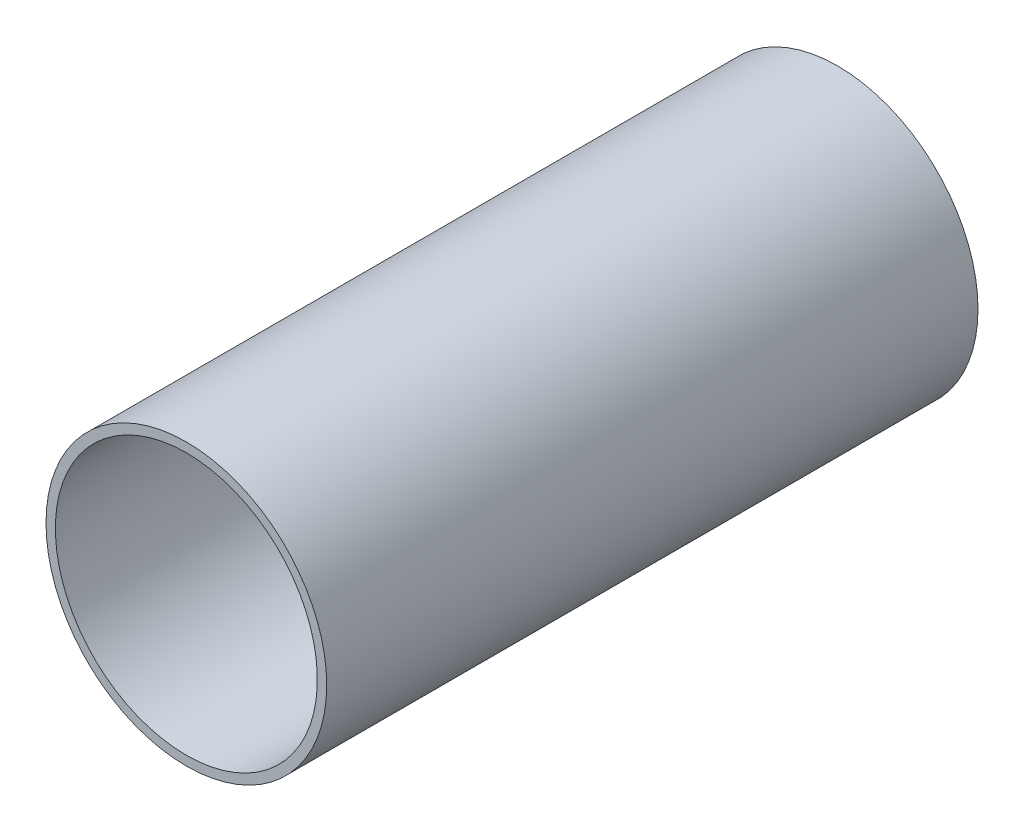
ISO-10303-21;
HEADER;
FILE_DESCRIPTION(('STEP AP214'),'2;1');
FILE_NAME('part.step','',(''),(''),'','','');
FILE_SCHEMA(('AUTOMOTIVE_DESIGN { 1 0 10303 214 1 1 1 1 }'));
ENDSEC;
DATA;
#1=APPLICATION_CONTEXT('core data for automotive mechanical design processes');
#2=APPLICATION_PROTOCOL_DEFINITION('international standard','automotive_design',2000,#1);
#3=PRODUCT_CONTEXT('',#1,'mechanical');
#4=PRODUCT('Part','Part','',(#3));
#5=PRODUCT_RELATED_PRODUCT_CATEGORY('part','',(#4));
#6=PRODUCT_DEFINITION_FORMATION('','',#4);
#7=PRODUCT_DEFINITION_CONTEXT('part definition',#1,'design');
#8=PRODUCT_DEFINITION('design','',#6,#7);
#9=PRODUCT_DEFINITION_SHAPE('','',#8);
#10=(LENGTH_UNIT() NAMED_UNIT(*) SI_UNIT(.MILLI.,.METRE.));
#11=(NAMED_UNIT(*) PLANE_ANGLE_UNIT() SI_UNIT($,.RADIAN.));
#12=(NAMED_UNIT(*) SI_UNIT($,.STERADIAN.) SOLID_ANGLE_UNIT());
#13=UNCERTAINTY_MEASURE_WITH_UNIT(LENGTH_MEASURE(1.E-05),#10,'distance_accuracy_value','');
#14=(GEOMETRIC_REPRESENTATION_CONTEXT(3) GLOBAL_UNCERTAINTY_ASSIGNED_CONTEXT((#13)) GLOBAL_UNIT_ASSIGNED_CONTEXT((#10,
#11,#12)) REPRESENTATION_CONTEXT('',''));
#15=CARTESIAN_POINT('',(0.,0.,0.));
#16=DIRECTION('',(0.,0.,1.));
#17=DIRECTION('',(1.,0.,0.));
#18=AXIS2_PLACEMENT_3D('',#15,#16,#17);
#19=CARTESIAN_POINT('',(115.401,-113.808,-0.045));
#20=DIRECTION('',(0.,0.,-1.));
#21=DIRECTION('',(0.,-1.,0.));
#22=AXIS2_PLACEMENT_3D('',#19,#20,#21);
#23=CYLINDRICAL_SURFACE('',#22,0.35);
#24=CARTESIAN_POINT('',(115.401,-113.808,-0.035));
#25=DIRECTION('',(0.,0.,-1.));
#26=DIRECTION('',(0.,-1.,0.));
#27=AXIS2_PLACEMENT_3D('',#24,#25,#26);
#28=CIRCLE('',#27,0.35);
#29=CARTESIAN_POINT('',(115.401,-114.158,-0.035));
#30=VERTEX_POINT('',#29);
#31=EDGE_CURVE('E64',#30,#30,#28,.T.);
#32=ORIENTED_EDGE('',*,*,#31,.T.);
#33=DIRECTION('',(0.,0.,1.));
#34=VECTOR('',#33,1.);
#35=CARTESIAN_POINT('',(115.401,-114.158,-0.045));
#36=LINE('',#35,#34);
#37=CARTESIAN_POINT('',(115.401,-114.158,1.705));
#38=VERTEX_POINT('',#37);
#39=EDGE_CURVE('E11',#30,#38,#36,.T.);
#40=ORIENTED_EDGE('',*,*,#39,.T.);
#41=CARTESIAN_POINT('',(115.401,-113.808,1.705));
#42=DIRECTION('',(0.,0.,-1.));
#43=DIRECTION('',(0.,-1.,0.));
#44=AXIS2_PLACEMENT_3D('',#41,#42,#43);
#45=CIRCLE('',#44,0.35);
#46=EDGE_CURVE('E25',#38,#38,#45,.T.);
#47=ORIENTED_EDGE('',*,*,#46,.F.);
#48=ORIENTED_EDGE('',*,*,#39,.F.);
#49=EDGE_LOOP('',(#32,#40,#47,#48));
#50=FACE_BOUND('',#49,.T.);
#51=ADVANCED_FACE('F17',(#50),#23,.F.);
#52=CARTESIAN_POINT('',(115.401,-114.183,1.705));
#53=DIRECTION('',(0.,0.,1.));
#54=DIRECTION('',(1.,0.,0.));
#55=AXIS2_PLACEMENT_3D('',#52,#53,#54);
#56=PLANE('',#55);
#57=ORIENTED_EDGE('',*,*,#46,.T.);
#58=EDGE_LOOP('',(#57));
#59=FACE_BOUND('',#58,.T.);
#60=CARTESIAN_POINT('',(115.401,-113.808,1.705));
#61=DIRECTION('',(0.,0.,1.));
#62=DIRECTION('',(0.,-1.,0.));
#63=AXIS2_PLACEMENT_3D('',#60,#61,#62);
#64=CIRCLE('',#63,0.375);
#65=CARTESIAN_POINT('',(115.401,-114.183,1.705));
#66=VERTEX_POINT('',#65);
#67=EDGE_CURVE('E56',#66,#66,#64,.T.);
#68=ORIENTED_EDGE('',*,*,#67,.T.);
#69=EDGE_LOOP('',(#68));
#70=FACE_BOUND('',#69,.T.);
#71=ADVANCED_FACE('F73',(#59,#70),#56,.T.);
#72=CARTESIAN_POINT('',(115.401,-114.183,-0.035));
#73=DIRECTION('',(0.,0.,1.));
#74=DIRECTION('',(1.,0.,0.));
#75=AXIS2_PLACEMENT_3D('',#72,#73,#74);
#76=PLANE('',#75);
#77=ORIENTED_EDGE('',*,*,#31,.F.);
#78=EDGE_LOOP('',(#77));
#79=FACE_BOUND('',#78,.T.);
#80=CARTESIAN_POINT('',(115.401,-113.808,-0.035));
#81=DIRECTION('',(0.,0.,1.));
#82=DIRECTION('',(0.,-1.,0.));
#83=AXIS2_PLACEMENT_3D('',#80,#81,#82);
#84=CIRCLE('',#83,0.375);
#85=CARTESIAN_POINT('',(115.401,-114.183,-0.035));
#86=VERTEX_POINT('',#85);
#87=EDGE_CURVE('E55',#86,#86,#84,.T.);
#88=ORIENTED_EDGE('',*,*,#87,.F.);
#89=EDGE_LOOP('',(#88));
#90=FACE_BOUND('',#89,.T.);
#91=ADVANCED_FACE('F82',(#79,#90),#76,.F.);
#92=CARTESIAN_POINT('',(115.401,-113.808,-0.035));
#93=DIRECTION('',(0.,0.,-1.));
#94=DIRECTION('',(0.,-1.,0.));
#95=AXIS2_PLACEMENT_3D('',#92,#93,#94);
#96=CYLINDRICAL_SURFACE('',#95,0.375);
#97=ORIENTED_EDGE('',*,*,#87,.T.);
#98=DIRECTION('',(0.,0.,1.));
#99=VECTOR('',#98,1.);
#100=CARTESIAN_POINT('',(115.401,-114.183,-0.035));
#101=LINE('',#100,#99);
#102=EDGE_CURVE('E52',#86,#66,#101,.T.);
#103=ORIENTED_EDGE('',*,*,#102,.T.);
#104=ORIENTED_EDGE('',*,*,#67,.F.);
#105=ORIENTED_EDGE('',*,*,#102,.F.);
#106=EDGE_LOOP('',(#97,#103,#104,#105));
#107=FACE_BOUND('',#106,.T.);
#108=ADVANCED_FACE('F53',(#107),#96,.T.);
#109=CLOSED_SHELL('',(#51,#71,#91,#108));
#110=MANIFOLD_SOLID_BREP('B1',#109);
#111=ADVANCED_BREP_SHAPE_REPRESENTATION('',(#18,#110),#14);
#112=SHAPE_DEFINITION_REPRESENTATION(#9,#111);
ENDSEC;
END-ISO-10303-21;
